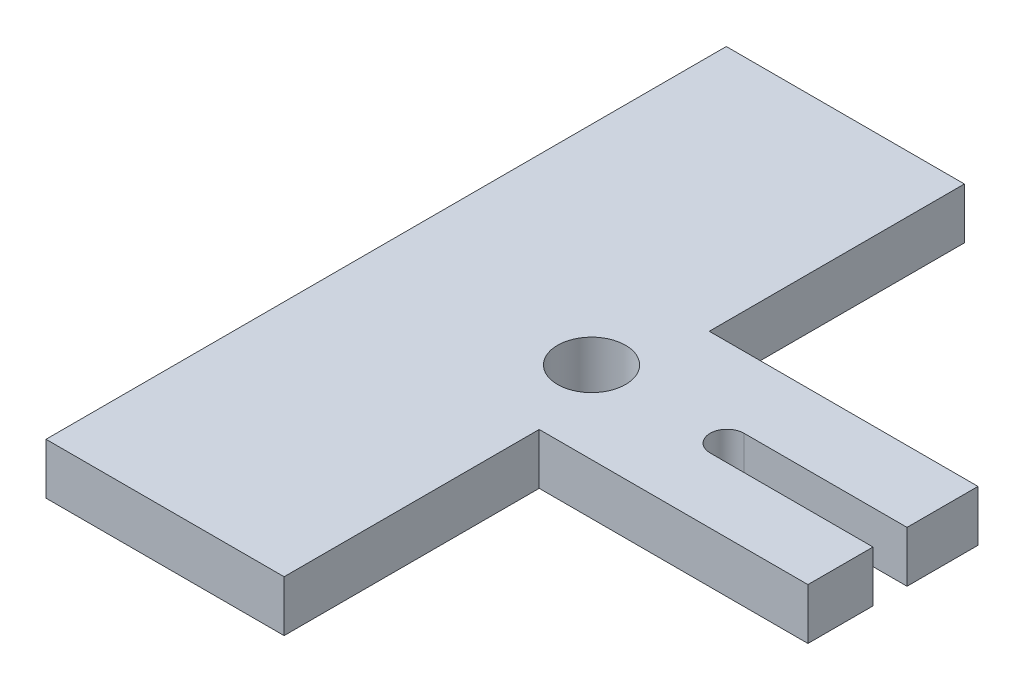
ISO-10303-21;
HEADER;
FILE_DESCRIPTION(('STEP AP214'),'2;1');
FILE_NAME('part.step','',(''),(''),'','','');
FILE_SCHEMA(('AUTOMOTIVE_DESIGN { 1 0 10303 214 1 1 1 1 }'));
ENDSEC;
DATA;
#1=APPLICATION_CONTEXT('core data for automotive mechanical design processes');
#2=APPLICATION_PROTOCOL_DEFINITION('international standard','automotive_design',2000,#1);
#3=PRODUCT_CONTEXT('',#1,'mechanical');
#4=PRODUCT('Part','Part','',(#3));
#5=PRODUCT_RELATED_PRODUCT_CATEGORY('part','',(#4));
#6=PRODUCT_DEFINITION_FORMATION('','',#4);
#7=PRODUCT_DEFINITION_CONTEXT('part definition',#1,'design');
#8=PRODUCT_DEFINITION('design','',#6,#7);
#9=PRODUCT_DEFINITION_SHAPE('','',#8);
#10=(LENGTH_UNIT() NAMED_UNIT(*) SI_UNIT(.MILLI.,.METRE.));
#11=(NAMED_UNIT(*) PLANE_ANGLE_UNIT() SI_UNIT($,.RADIAN.));
#12=(NAMED_UNIT(*) SI_UNIT($,.STERADIAN.) SOLID_ANGLE_UNIT());
#13=UNCERTAINTY_MEASURE_WITH_UNIT(LENGTH_MEASURE(1.E-05),#10,'distance_accuracy_value','');
#14=(GEOMETRIC_REPRESENTATION_CONTEXT(3) GLOBAL_UNCERTAINTY_ASSIGNED_CONTEXT((#13)) GLOBAL_UNIT_ASSIGNED_CONTEXT((#10,
#11,#12)) REPRESENTATION_CONTEXT('',''));
#15=CARTESIAN_POINT('',(0.,0.,0.));
#16=DIRECTION('',(0.,0.,1.));
#17=DIRECTION('',(1.,0.,0.));
#18=AXIS2_PLACEMENT_3D('',#15,#16,#17);
#19=CARTESIAN_POINT('',(0.,1.5,0.));
#20=DIRECTION('',(0.,1.,0.));
#21=DIRECTION('',(0.,0.,1.));
#22=AXIS2_PLACEMENT_3D('',#19,#20,#21);
#23=PLANE('',#22);
#24=CARTESIAN_POINT('',(-10.1209897873658,1.5,-3.63838157806826));
#25=DIRECTION('',(0.,1.,0.));
#26=DIRECTION('',(0.,0.,1.));
#27=AXIS2_PLACEMENT_3D('',#24,#25,#26);
#28=CIRCLE('',#27,1.);
#29=CARTESIAN_POINT('',(-10.1209897873658,1.5,-2.63838157806826));
#30=VERTEX_POINT('',#29);
#31=EDGE_CURVE('E194',#30,#30,#28,.T.);
#32=ORIENTED_EDGE('',*,*,#31,.F.);
#33=EDGE_LOOP('',(#32));
#34=FACE_BOUND('',#33,.T.);
#35=CARTESIAN_POINT('',(-6.13679884939254,1.5,-3.63838157806826));
#36=DIRECTION('',(0.,1.,0.));
#37=DIRECTION('',(0.,0.,1.));
#38=AXIS2_PLACEMENT_3D('',#35,#36,#37);
#39=CIRCLE('',#38,0.5);
#40=CARTESIAN_POINT('',(-6.13679884939255,1.5,-4.13838157806826));
#41=VERTEX_POINT('',#40);
#42=CARTESIAN_POINT('',(-6.13679884939255,1.5,-3.13838157806826));
#43=VERTEX_POINT('',#42);
#44=EDGE_CURVE('E141',#41,#43,#39,.T.);
#45=ORIENTED_EDGE('',*,*,#44,.F.);
#46=DIRECTION('',(1.,0.,0.));
#47=VECTOR('',#46,1.);
#48=CARTESIAN_POINT('',(-6.13679884939255,1.5,-4.13838157806826));
#49=LINE('',#48,#47);
#50=CARTESIAN_POINT('',(-1.34641833810888,1.5,-4.13838157806826));
#51=VERTEX_POINT('',#50);
#52=EDGE_CURVE('E146',#41,#51,#49,.T.);
#53=ORIENTED_EDGE('',*,*,#52,.T.);
#54=DIRECTION('',(0.,0.,1.));
#55=VECTOR('',#54,1.);
#56=CARTESIAN_POINT('',(-1.34641833810888,1.5,-6.22492838076218));
#57=LINE('',#56,#55);
#58=CARTESIAN_POINT('',(-1.34641833810888,1.5,-6.22492838076218));
#59=VERTEX_POINT('',#58);
#60=EDGE_CURVE('E174',#59,#51,#57,.T.);
#61=ORIENTED_EDGE('',*,*,#60,.F.);
#62=DIRECTION('',(1.,0.,0.));
#63=VECTOR('',#62,1.);
#64=CARTESIAN_POINT('',(-9.24641833810888,1.5,-6.22492838076218));
#65=LINE('',#64,#63);
#66=CARTESIAN_POINT('',(-9.24641833810888,1.5,-6.22492838076218));
#67=VERTEX_POINT('',#66);
#68=EDGE_CURVE('E170',#67,#59,#65,.T.);
#69=ORIENTED_EDGE('',*,*,#68,.F.);
#70=DIRECTION('',(0.,0.,1.));
#71=VECTOR('',#70,1.);
#72=CARTESIAN_POINT('',(-9.24641833810888,1.5,-13.7249283667622));
#73=LINE('',#72,#71);
#74=CARTESIAN_POINT('',(-9.24641833810888,1.5,-13.7249283667622));
#75=VERTEX_POINT('',#74);
#76=EDGE_CURVE('E154',#75,#67,#73,.T.);
#77=ORIENTED_EDGE('',*,*,#76,.F.);
#78=DIRECTION('',(-1.,0.,0.));
#79=VECTOR('',#78,1.);
#80=CARTESIAN_POINT('',(-16.2464183381089,1.5,-13.7249283667622));
#81=LINE('',#80,#79);
#82=CARTESIAN_POINT('',(-16.2464183381089,1.5,-13.7249283667622));
#83=VERTEX_POINT('',#82);
#84=EDGE_CURVE('E201',#75,#83,#81,.T.);
#85=ORIENTED_EDGE('',*,*,#84,.T.);
#86=DIRECTION('',(0.,0.,1.));
#87=VECTOR('',#86,1.);
#88=CARTESIAN_POINT('',(-16.2464183381089,1.5,-13.7249283667622));
#89=LINE('',#88,#87);
#90=CARTESIAN_POINT('',(-16.2464183381089,1.5,6.27507163323782));
#91=VERTEX_POINT('',#90);
#92=EDGE_CURVE('E203',#83,#91,#89,.T.);
#93=ORIENTED_EDGE('',*,*,#92,.T.);
#94=DIRECTION('',(1.,0.,0.));
#95=VECTOR('',#94,1.);
#96=CARTESIAN_POINT('',(-16.2464183381089,1.5,6.27507163323782));
#97=LINE('',#96,#95);
#98=CARTESIAN_POINT('',(-9.24641833810888,1.5,6.27507163323782));
#99=VERTEX_POINT('',#98);
#100=EDGE_CURVE('E206',#91,#99,#97,.T.);
#101=ORIENTED_EDGE('',*,*,#100,.T.);
#102=DIRECTION('',(0.,0.,1.));
#103=VECTOR('',#102,1.);
#104=CARTESIAN_POINT('',(-9.24641833810888,1.5,6.27507163323782));
#105=LINE('',#104,#103);
#106=CARTESIAN_POINT('',(-9.24641833810888,1.5,-1.22492835276218));
#107=VERTEX_POINT('',#106);
#108=EDGE_CURVE('E159',#107,#99,#105,.T.);
#109=ORIENTED_EDGE('',*,*,#108,.F.);
#110=DIRECTION('',(1.,0.,0.));
#111=VECTOR('',#110,1.);
#112=CARTESIAN_POINT('',(-9.24641833810888,1.5,-1.22492835276218));
#113=LINE('',#112,#111);
#114=CARTESIAN_POINT('',(-1.34641833810888,1.5,-1.22492835276218));
#115=VERTEX_POINT('',#114);
#116=EDGE_CURVE('E177',#107,#115,#113,.T.);
#117=ORIENTED_EDGE('',*,*,#116,.T.);
#118=CARTESIAN_POINT('',(-1.34641833810888,1.5,-3.13838157806826));
#119=VERTEX_POINT('',#118);
#120=EDGE_CURVE('E173',#119,#115,#57,.T.);
#121=ORIENTED_EDGE('',*,*,#120,.F.);
#122=DIRECTION('',(-1.,0.,0.));
#123=VECTOR('',#122,1.);
#124=CARTESIAN_POINT('',(-0.966349773426508,1.5,-3.13838157806826));
#125=LINE('',#124,#123);
#126=EDGE_CURVE('E54',#119,#43,#125,.T.);
#127=ORIENTED_EDGE('',*,*,#126,.T.);
#128=EDGE_LOOP('',(#45,#53,#61,#69,#77,#85,#93,#101,#109,#117,#121,#127));
#129=FACE_BOUND('',#128,.T.);
#130=ADVANCED_FACE('F39',(#34,#129),#23,.T.);
#131=CARTESIAN_POINT('',(0.,0.,0.));
#132=DIRECTION('',(0.,1.,0.));
#133=DIRECTION('',(0.,0.,1.));
#134=AXIS2_PLACEMENT_3D('',#131,#132,#133);
#135=PLANE('',#134);
#136=CARTESIAN_POINT('',(-10.1209897873658,0.,-3.63838157806826));
#137=DIRECTION('',(0.,1.,0.));
#138=DIRECTION('',(0.,0.,1.));
#139=AXIS2_PLACEMENT_3D('',#136,#137,#138);
#140=CIRCLE('',#139,1.);
#141=CARTESIAN_POINT('',(-10.1209897873658,0.,-2.63838157806826));
#142=VERTEX_POINT('',#141);
#143=EDGE_CURVE('E195',#142,#142,#140,.T.);
#144=ORIENTED_EDGE('',*,*,#143,.T.);
#145=EDGE_LOOP('',(#144));
#146=FACE_BOUND('',#145,.T.);
#147=DIRECTION('',(1.,0.,0.));
#148=VECTOR('',#147,1.);
#149=CARTESIAN_POINT('',(-6.13679884939255,0.,-4.13838157806826));
#150=LINE('',#149,#148);
#151=CARTESIAN_POINT('',(-6.13679884939255,0.,-4.13838157806826));
#152=VERTEX_POINT('',#151);
#153=CARTESIAN_POINT('',(-1.34641833810888,0.,-4.13838157806826));
#154=VERTEX_POINT('',#153);
#155=EDGE_CURVE('E133',#152,#154,#150,.T.);
#156=ORIENTED_EDGE('',*,*,#155,.F.);
#157=CARTESIAN_POINT('',(-6.13679884939254,0.,-3.63838157806826));
#158=DIRECTION('',(0.,1.,0.));
#159=DIRECTION('',(0.,0.,1.));
#160=AXIS2_PLACEMENT_3D('',#157,#158,#159);
#161=CIRCLE('',#160,0.5);
#162=CARTESIAN_POINT('',(-6.13679884939255,0.,-3.13838157806826));
#163=VERTEX_POINT('',#162);
#164=EDGE_CURVE('E134',#152,#163,#161,.T.);
#165=ORIENTED_EDGE('',*,*,#164,.T.);
#166=DIRECTION('',(-1.,0.,0.));
#167=VECTOR('',#166,1.);
#168=CARTESIAN_POINT('',(-0.966349773426508,0.,-3.13838157806826));
#169=LINE('',#168,#167);
#170=CARTESIAN_POINT('',(-1.34641833810888,0.,-3.13838157806826));
#171=VERTEX_POINT('',#170);
#172=EDGE_CURVE('E125',#171,#163,#169,.T.);
#173=ORIENTED_EDGE('',*,*,#172,.F.);
#174=DIRECTION('',(0.,0.,1.));
#175=VECTOR('',#174,1.);
#176=CARTESIAN_POINT('',(-1.34641833810888,0.,-6.22492838076218));
#177=LINE('',#176,#175);
#178=CARTESIAN_POINT('',(-1.34641833810888,0.,-1.22492835276218));
#179=VERTEX_POINT('',#178);
#180=EDGE_CURVE('E161',#171,#179,#177,.T.);
#181=ORIENTED_EDGE('',*,*,#180,.T.);
#182=DIRECTION('',(1.,0.,0.));
#183=VECTOR('',#182,1.);
#184=CARTESIAN_POINT('',(-9.24641833810888,0.,-1.22492835276218));
#185=LINE('',#184,#183);
#186=CARTESIAN_POINT('',(-9.24641833810888,0.,-1.22492835276218));
#187=VERTEX_POINT('',#186);
#188=EDGE_CURVE('E164',#187,#179,#185,.T.);
#189=ORIENTED_EDGE('',*,*,#188,.F.);
#190=DIRECTION('',(0.,0.,1.));
#191=VECTOR('',#190,1.);
#192=CARTESIAN_POINT('',(-9.24641833810888,0.,0.));
#193=LINE('',#192,#191);
#194=CARTESIAN_POINT('',(-9.24641833810888,0.,6.27507163323782));
#195=VERTEX_POINT('',#194);
#196=EDGE_CURVE('E220',#187,#195,#193,.T.);
#197=ORIENTED_EDGE('',*,*,#196,.T.);
#198=DIRECTION('',(1.,0.,0.));
#199=VECTOR('',#198,1.);
#200=CARTESIAN_POINT('',(-16.2464183381089,0.,6.27507163323782));
#201=LINE('',#200,#199);
#202=CARTESIAN_POINT('',(-16.2464183381089,0.,6.27507163323782));
#203=VERTEX_POINT('',#202);
#204=EDGE_CURVE('E204',#203,#195,#201,.T.);
#205=ORIENTED_EDGE('',*,*,#204,.F.);
#206=DIRECTION('',(0.,0.,1.));
#207=VECTOR('',#206,1.);
#208=CARTESIAN_POINT('',(-16.2464183381089,0.,-13.7249283667622));
#209=LINE('',#208,#207);
#210=CARTESIAN_POINT('',(-16.2464183381089,0.,-13.7249283667622));
#211=VERTEX_POINT('',#210);
#212=EDGE_CURVE('E211',#211,#203,#209,.T.);
#213=ORIENTED_EDGE('',*,*,#212,.F.);
#214=DIRECTION('',(-1.,0.,0.));
#215=VECTOR('',#214,1.);
#216=CARTESIAN_POINT('',(-16.2464183381089,0.,-13.7249283667622));
#217=LINE('',#216,#215);
#218=CARTESIAN_POINT('',(-9.24641833810888,0.,-13.7249283667622));
#219=VERTEX_POINT('',#218);
#220=EDGE_CURVE('E198',#219,#211,#217,.T.);
#221=ORIENTED_EDGE('',*,*,#220,.F.);
#222=DIRECTION('',(0.,0.,1.));
#223=VECTOR('',#222,1.);
#224=CARTESIAN_POINT('',(-9.24641833810888,0.,-13.7249283667622));
#225=LINE('',#224,#223);
#226=CARTESIAN_POINT('',(-9.24641833810888,0.,-6.22492838076218));
#227=VERTEX_POINT('',#226);
#228=EDGE_CURVE('E156',#219,#227,#225,.T.);
#229=ORIENTED_EDGE('',*,*,#228,.T.);
#230=DIRECTION('',(1.,0.,0.));
#231=VECTOR('',#230,1.);
#232=CARTESIAN_POINT('',(-9.24641833810888,0.,-6.22492838076218));
#233=LINE('',#232,#231);
#234=CARTESIAN_POINT('',(-1.34641833810888,0.,-6.22492838076218));
#235=VERTEX_POINT('',#234);
#236=EDGE_CURVE('E62',#227,#235,#233,.T.);
#237=ORIENTED_EDGE('',*,*,#236,.T.);
#238=EDGE_CURVE('E162',#235,#154,#177,.T.);
#239=ORIENTED_EDGE('',*,*,#238,.T.);
#240=EDGE_LOOP('',(#156,#165,#173,#181,#189,#197,#205,#213,#221,#229,#237,#239));
#241=FACE_BOUND('',#240,.T.);
#242=ADVANCED_FACE('F144',(#146,#241),#135,.F.);
#243=CARTESIAN_POINT('',(-1.34641833810888,0.,-6.22492838076218));
#244=DIRECTION('',(-1.,0.,0.));
#245=DIRECTION('',(0.,0.,1.));
#246=AXIS2_PLACEMENT_3D('',#243,#244,#245);
#247=PLANE('',#246);
#248=DIRECTION('',(0.,1.,0.));
#249=VECTOR('',#248,1.);
#250=CARTESIAN_POINT('',(-1.34641833810888,0.,-4.13838157806826));
#251=LINE('',#250,#249);
#252=EDGE_CURVE('E11',#154,#51,#251,.T.);
#253=ORIENTED_EDGE('',*,*,#252,.F.);
#254=ORIENTED_EDGE('',*,*,#238,.F.);
#255=DIRECTION('',(0.,1.,0.));
#256=VECTOR('',#255,1.);
#257=CARTESIAN_POINT('',(-1.34641833810888,0.,-6.22492838076218));
#258=LINE('',#257,#256);
#259=EDGE_CURVE('E187',#235,#59,#258,.T.);
#260=ORIENTED_EDGE('',*,*,#259,.T.);
#261=ORIENTED_EDGE('',*,*,#60,.T.);
#262=EDGE_LOOP('',(#253,#254,#260,#261));
#263=FACE_BOUND('',#262,.T.);
#264=ADVANCED_FACE('F249',(#263),#247,.F.);
#265=DIRECTION('',(0.,-1.,0.));
#266=VECTOR('',#265,1.);
#267=CARTESIAN_POINT('',(-1.34641833810888,0.,-3.13838157806826));
#268=LINE('',#267,#266);
#269=EDGE_CURVE('E47',#119,#171,#268,.T.);
#270=ORIENTED_EDGE('',*,*,#269,.F.);
#271=ORIENTED_EDGE('',*,*,#120,.T.);
#272=DIRECTION('',(0.,1.,0.));
#273=VECTOR('',#272,1.);
#274=CARTESIAN_POINT('',(-1.34641833810888,0.,-1.22492835276218));
#275=LINE('',#274,#273);
#276=EDGE_CURVE('E184',#179,#115,#275,.T.);
#277=ORIENTED_EDGE('',*,*,#276,.F.);
#278=ORIENTED_EDGE('',*,*,#180,.F.);
#279=EDGE_LOOP('',(#270,#271,#277,#278));
#280=FACE_BOUND('',#279,.T.);
#281=ADVANCED_FACE('F258',(#280),#247,.F.);
#282=CARTESIAN_POINT('',(-16.2464183381089,1.5,-13.7249283667622));
#283=DIRECTION('',(0.,0.,1.));
#284=DIRECTION('',(1.,0.,0.));
#285=AXIS2_PLACEMENT_3D('',#282,#283,#284);
#286=PLANE('',#285);
#287=ORIENTED_EDGE('',*,*,#84,.F.);
#288=DIRECTION('',(0.,1.,0.));
#289=VECTOR('',#288,1.);
#290=CARTESIAN_POINT('',(-9.24641833810888,0.,-13.7249283667622));
#291=LINE('',#290,#289);
#292=EDGE_CURVE('E167',#219,#75,#291,.T.);
#293=ORIENTED_EDGE('',*,*,#292,.F.);
#294=ORIENTED_EDGE('',*,*,#220,.T.);
#295=DIRECTION('',(0.,-1.,0.));
#296=VECTOR('',#295,1.);
#297=CARTESIAN_POINT('',(-16.2464183381089,1.5,-13.7249283667622));
#298=LINE('',#297,#296);
#299=EDGE_CURVE('E217',#83,#211,#298,.T.);
#300=ORIENTED_EDGE('',*,*,#299,.F.);
#301=EDGE_LOOP('',(#287,#293,#294,#300));
#302=FACE_BOUND('',#301,.T.);
#303=ADVANCED_FACE('F41',(#302),#286,.F.);
#304=CARTESIAN_POINT('',(-16.2464183381089,1.5,-13.7249283667622));
#305=DIRECTION('',(1.,0.,0.));
#306=DIRECTION('',(0.,0.,-1.));
#307=AXIS2_PLACEMENT_3D('',#304,#305,#306);
#308=PLANE('',#307);
#309=ORIENTED_EDGE('',*,*,#212,.T.);
#310=DIRECTION('',(0.,-1.,0.));
#311=VECTOR('',#310,1.);
#312=CARTESIAN_POINT('',(-16.2464183381089,1.5,6.27507163323782));
#313=LINE('',#312,#311);
#314=EDGE_CURVE('E209',#91,#203,#313,.T.);
#315=ORIENTED_EDGE('',*,*,#314,.F.);
#316=ORIENTED_EDGE('',*,*,#92,.F.);
#317=ORIENTED_EDGE('',*,*,#299,.T.);
#318=EDGE_LOOP('',(#309,#315,#316,#317));
#319=FACE_BOUND('',#318,.T.);
#320=ADVANCED_FACE('F233',(#319),#308,.F.);
#321=CARTESIAN_POINT('',(-16.2464183381089,1.5,6.27507163323782));
#322=DIRECTION('',(0.,0.,-1.));
#323=DIRECTION('',(-1.,0.,0.));
#324=AXIS2_PLACEMENT_3D('',#321,#322,#323);
#325=PLANE('',#324);
#326=ORIENTED_EDGE('',*,*,#204,.T.);
#327=DIRECTION('',(0.,1.,0.));
#328=VECTOR('',#327,1.);
#329=CARTESIAN_POINT('',(-9.24641833810888,1.5,6.27507163323782));
#330=LINE('',#329,#328);
#331=EDGE_CURVE('E183',#195,#99,#330,.T.);
#332=ORIENTED_EDGE('',*,*,#331,.T.);
#333=ORIENTED_EDGE('',*,*,#100,.F.);
#334=ORIENTED_EDGE('',*,*,#314,.T.);
#335=EDGE_LOOP('',(#326,#332,#333,#334));
#336=FACE_BOUND('',#335,.T.);
#337=ADVANCED_FACE('F228',(#336),#325,.F.);
#338=CARTESIAN_POINT('',(-10.1209897873658,0.,-3.63838157806826));
#339=DIRECTION('',(0.,1.,0.));
#340=DIRECTION('',(0.,0.,1.));
#341=AXIS2_PLACEMENT_3D('',#338,#339,#340);
#342=CYLINDRICAL_SURFACE('',#341,1.);
#343=ORIENTED_EDGE('',*,*,#143,.F.);
#344=EDGE_LOOP('',(#343));
#345=FACE_BOUND('',#344,.T.);
#346=ORIENTED_EDGE('',*,*,#31,.T.);
#347=EDGE_LOOP('',(#346));
#348=FACE_BOUND('',#347,.T.);
#349=ADVANCED_FACE('F263',(#345,#348),#342,.F.);
#350=CARTESIAN_POINT('',(-9.24641833810888,0.,6.27507163323782));
#351=DIRECTION('',(-1.,0.,0.));
#352=DIRECTION('',(0.,0.,1.));
#353=AXIS2_PLACEMENT_3D('',#350,#351,#352);
#354=PLANE('',#353);
#355=ORIENTED_EDGE('',*,*,#196,.F.);
#356=DIRECTION('',(0.,1.,0.));
#357=VECTOR('',#356,1.);
#358=CARTESIAN_POINT('',(-9.24641833810888,0.,-1.22492835276218));
#359=LINE('',#358,#357);
#360=EDGE_CURVE('E181',#187,#107,#359,.T.);
#361=ORIENTED_EDGE('',*,*,#360,.T.);
#362=ORIENTED_EDGE('',*,*,#108,.T.);
#363=ORIENTED_EDGE('',*,*,#331,.F.);
#364=EDGE_LOOP('',(#355,#361,#362,#363));
#365=FACE_BOUND('',#364,.T.);
#366=ADVANCED_FACE('F261',(#365),#354,.F.);
#367=CARTESIAN_POINT('',(-9.24641833810888,0.,-1.22492835276218));
#368=DIRECTION('',(0.,0.,1.));
#369=DIRECTION('',(1.,0.,0.));
#370=AXIS2_PLACEMENT_3D('',#367,#368,#369);
#371=PLANE('',#370);
#372=ORIENTED_EDGE('',*,*,#116,.F.);
#373=ORIENTED_EDGE('',*,*,#360,.F.);
#374=ORIENTED_EDGE('',*,*,#188,.T.);
#375=ORIENTED_EDGE('',*,*,#276,.T.);
#376=EDGE_LOOP('',(#372,#373,#374,#375));
#377=FACE_BOUND('',#376,.T.);
#378=ADVANCED_FACE('F260',(#377),#371,.T.);
#379=CARTESIAN_POINT('',(-9.24641833810888,0.,-6.22492838076218));
#380=DIRECTION('',(0.,0.,1.));
#381=DIRECTION('',(1.,0.,0.));
#382=AXIS2_PLACEMENT_3D('',#379,#380,#381);
#383=PLANE('',#382);
#384=ORIENTED_EDGE('',*,*,#68,.T.);
#385=ORIENTED_EDGE('',*,*,#259,.F.);
#386=ORIENTED_EDGE('',*,*,#236,.F.);
#387=DIRECTION('',(0.,1.,0.));
#388=VECTOR('',#387,1.);
#389=CARTESIAN_POINT('',(-9.24641833810888,0.,-6.22492838076218));
#390=LINE('',#389,#388);
#391=EDGE_CURVE('E189',#227,#67,#390,.T.);
#392=ORIENTED_EDGE('',*,*,#391,.T.);
#393=EDGE_LOOP('',(#384,#385,#386,#392));
#394=FACE_BOUND('',#393,.T.);
#395=ADVANCED_FACE('F245',(#394),#383,.F.);
#396=CARTESIAN_POINT('',(-9.24641833810888,0.,-13.7249283667622));
#397=DIRECTION('',(-1.,0.,0.));
#398=DIRECTION('',(0.,0.,1.));
#399=AXIS2_PLACEMENT_3D('',#396,#397,#398);
#400=PLANE('',#399);
#401=ORIENTED_EDGE('',*,*,#76,.T.);
#402=ORIENTED_EDGE('',*,*,#391,.F.);
#403=ORIENTED_EDGE('',*,*,#228,.F.);
#404=ORIENTED_EDGE('',*,*,#292,.T.);
#405=EDGE_LOOP('',(#401,#402,#403,#404));
#406=FACE_BOUND('',#405,.T.);
#407=ADVANCED_FACE('F241',(#406),#400,.F.);
#408=CARTESIAN_POINT('',(-6.13679884939255,0.,-4.13838157806826));
#409=DIRECTION('',(0.,0.,1.));
#410=DIRECTION('',(1.,0.,0.));
#411=AXIS2_PLACEMENT_3D('',#408,#409,#410);
#412=PLANE('',#411);
#413=ORIENTED_EDGE('',*,*,#252,.T.);
#414=ORIENTED_EDGE('',*,*,#52,.F.);
#415=DIRECTION('',(0.,1.,0.));
#416=VECTOR('',#415,1.);
#417=CARTESIAN_POINT('',(-6.13679884939255,0.,-4.13838157806826));
#418=LINE('',#417,#416);
#419=EDGE_CURVE('E142',#152,#41,#418,.T.);
#420=ORIENTED_EDGE('',*,*,#419,.F.);
#421=ORIENTED_EDGE('',*,*,#155,.T.);
#422=EDGE_LOOP('',(#413,#414,#420,#421));
#423=FACE_BOUND('',#422,.T.);
#424=ADVANCED_FACE('F252',(#423),#412,.T.);
#425=CARTESIAN_POINT('',(-0.966349773426508,0.,-3.13838157806826));
#426=DIRECTION('',(0.,0.,-1.));
#427=DIRECTION('',(-1.,0.,0.));
#428=AXIS2_PLACEMENT_3D('',#425,#426,#427);
#429=PLANE('',#428);
#430=ORIENTED_EDGE('',*,*,#269,.T.);
#431=ORIENTED_EDGE('',*,*,#172,.T.);
#432=DIRECTION('',(0.,1.,0.));
#433=VECTOR('',#432,1.);
#434=CARTESIAN_POINT('',(-6.13679884939255,0.,-3.13838157806826));
#435=LINE('',#434,#433);
#436=EDGE_CURVE('E128',#163,#43,#435,.T.);
#437=ORIENTED_EDGE('',*,*,#436,.T.);
#438=ORIENTED_EDGE('',*,*,#126,.F.);
#439=EDGE_LOOP('',(#430,#431,#437,#438));
#440=FACE_BOUND('',#439,.T.);
#441=ADVANCED_FACE('F127',(#440),#429,.T.);
#442=CARTESIAN_POINT('',(-6.13679884939254,0.,-3.63838157806826));
#443=DIRECTION('',(0.,1.,0.));
#444=DIRECTION('',(0.,0.,1.));
#445=AXIS2_PLACEMENT_3D('',#442,#443,#444);
#446=CYLINDRICAL_SURFACE('',#445,0.5);
#447=ORIENTED_EDGE('',*,*,#44,.T.);
#448=ORIENTED_EDGE('',*,*,#436,.F.);
#449=ORIENTED_EDGE('',*,*,#164,.F.);
#450=ORIENTED_EDGE('',*,*,#419,.T.);
#451=EDGE_LOOP('',(#447,#448,#449,#450));
#452=FACE_BOUND('',#451,.T.);
#453=ADVANCED_FACE('F138',(#452),#446,.F.);
#454=CLOSED_SHELL('',(#130,#242,#264,#281,#303,#320,#337,#349,#366,#378,#395,#407,#424,#441,#453));
#455=MANIFOLD_SOLID_BREP('B2',#454);
#456=ADVANCED_BREP_SHAPE_REPRESENTATION('',(#18,#455),#14);
#457=SHAPE_DEFINITION_REPRESENTATION(#9,#456);
ENDSEC;
END-ISO-10303-21;
